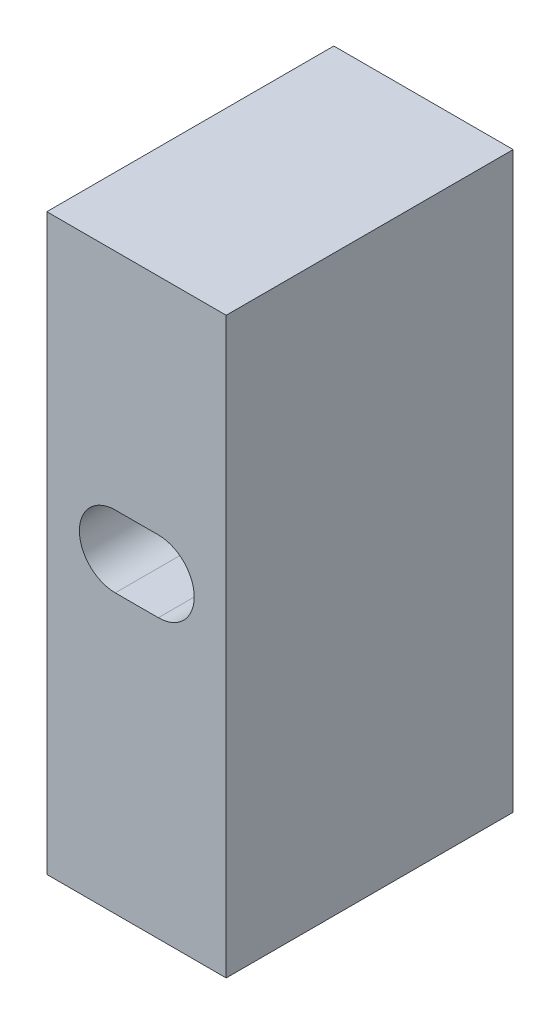
ISO-10303-21;
HEADER;
FILE_DESCRIPTION(('STEP AP214'),'2;1');
FILE_NAME('part.step','',(''),(''),'','','');
FILE_SCHEMA(('AUTOMOTIVE_DESIGN { 1 0 10303 214 1 1 1 1 }'));
ENDSEC;
DATA;
#1=APPLICATION_CONTEXT('core data for automotive mechanical design processes');
#2=APPLICATION_PROTOCOL_DEFINITION('international standard','automotive_design',2000,#1);
#3=PRODUCT_CONTEXT('',#1,'mechanical');
#4=PRODUCT('Part','Part','',(#3));
#5=PRODUCT_RELATED_PRODUCT_CATEGORY('part','',(#4));
#6=PRODUCT_DEFINITION_FORMATION('','',#4);
#7=PRODUCT_DEFINITION_CONTEXT('part definition',#1,'design');
#8=PRODUCT_DEFINITION('design','',#6,#7);
#9=PRODUCT_DEFINITION_SHAPE('','',#8);
#10=(LENGTH_UNIT() NAMED_UNIT(*) SI_UNIT(.MILLI.,.METRE.));
#11=(NAMED_UNIT(*) PLANE_ANGLE_UNIT() SI_UNIT($,.RADIAN.));
#12=(NAMED_UNIT(*) SI_UNIT($,.STERADIAN.) SOLID_ANGLE_UNIT());
#13=UNCERTAINTY_MEASURE_WITH_UNIT(LENGTH_MEASURE(1.E-05),#10,'distance_accuracy_value','');
#14=(GEOMETRIC_REPRESENTATION_CONTEXT(3) GLOBAL_UNCERTAINTY_ASSIGNED_CONTEXT((#13)) GLOBAL_UNIT_ASSIGNED_CONTEXT((#10,
#11,#12)) REPRESENTATION_CONTEXT('',''));
#15=CARTESIAN_POINT('',(0.,0.,0.));
#16=DIRECTION('',(0.,0.,1.));
#17=DIRECTION('',(1.,0.,0.));
#18=AXIS2_PLACEMENT_3D('',#15,#16,#17);
#19=CARTESIAN_POINT('',(0.,50.8,-25.4));
#20=DIRECTION('',(0.,0.,1.));
#21=DIRECTION('',(1.,0.,0.));
#22=AXIS2_PLACEMENT_3D('',#19,#20,#21);
#23=PLANE('',#22);
#24=DIRECTION('',(-1.,0.,0.));
#25=VECTOR('',#24,1.);
#26=CARTESIAN_POINT('',(0.,0.,-25.4));
#27=LINE('',#26,#25);
#28=CARTESIAN_POINT('',(15.875,0.,-25.4));
#29=VERTEX_POINT('',#28);
#30=CARTESIAN_POINT('',(0.,0.,-25.4));
#31=VERTEX_POINT('',#30);
#32=EDGE_CURVE('E230',#29,#31,#27,.T.);
#33=ORIENTED_EDGE('',*,*,#32,.T.);
#34=DIRECTION('',(0.,-1.,0.));
#35=VECTOR('',#34,1.);
#36=CARTESIAN_POINT('',(0.,50.8,-25.4));
#37=LINE('',#36,#35);
#38=CARTESIAN_POINT('',(0.,50.8,-25.4));
#39=VERTEX_POINT('',#38);
#40=EDGE_CURVE('E236',#39,#31,#37,.T.);
#41=ORIENTED_EDGE('',*,*,#40,.F.);
#42=DIRECTION('',(-1.,0.,0.));
#43=VECTOR('',#42,1.);
#44=CARTESIAN_POINT('',(0.,50.8,-25.4));
#45=LINE('',#44,#43);
#46=CARTESIAN_POINT('',(15.875,50.8,-25.4));
#47=VERTEX_POINT('',#46);
#48=EDGE_CURVE('E234',#47,#39,#45,.T.);
#49=ORIENTED_EDGE('',*,*,#48,.F.);
#50=DIRECTION('',(0.,-1.,0.));
#51=VECTOR('',#50,1.);
#52=CARTESIAN_POINT('',(15.875,50.8,-25.4));
#53=LINE('',#52,#51);
#54=EDGE_CURVE('E246',#47,#29,#53,.T.);
#55=ORIENTED_EDGE('',*,*,#54,.T.);
#56=EDGE_LOOP('',(#33,#41,#49,#55));
#57=FACE_BOUND('',#56,.T.);
#58=DIRECTION('',(1.,0.,0.));
#59=VECTOR('',#58,1.);
#60=CARTESIAN_POINT('',(6.05880185531833,30.9626000000028,-25.4));
#61=LINE('',#60,#59);
#62=CARTESIAN_POINT('',(6.05880185531833,30.9626000000028,-25.4));
#63=VERTEX_POINT('',#62);
#64=CARTESIAN_POINT('',(9.8688018553185,30.9626000000028,-25.4));
#65=VERTEX_POINT('',#64);
#66=EDGE_CURVE('E186',#63,#65,#61,.T.);
#67=ORIENTED_EDGE('',*,*,#66,.F.);
#68=CARTESIAN_POINT('',(6.05880185531834,27.7876000000028,-25.4));
#69=DIRECTION('',(0.,0.,1.));
#70=DIRECTION('',(1.,0.,0.));
#71=AXIS2_PLACEMENT_3D('',#68,#69,#70);
#72=CIRCLE('',#71,3.17499999999993);
#73=CARTESIAN_POINT('',(6.05880185531833,24.6126000000029,-25.4));
#74=VERTEX_POINT('',#73);
#75=EDGE_CURVE('E194',#63,#74,#72,.T.);
#76=ORIENTED_EDGE('',*,*,#75,.T.);
#77=DIRECTION('',(1.,0.,0.));
#78=VECTOR('',#77,1.);
#79=CARTESIAN_POINT('',(6.05880185531833,24.6126000000029,-25.4));
#80=LINE('',#79,#78);
#81=CARTESIAN_POINT('',(9.8688018553185,24.6126000000028,-25.4));
#82=VERTEX_POINT('',#81);
#83=EDGE_CURVE('E390',#74,#82,#80,.T.);
#84=ORIENTED_EDGE('',*,*,#83,.T.);
#85=CARTESIAN_POINT('',(9.8688018553185,27.7876000000028,-25.4));
#86=DIRECTION('',(0.,0.,1.));
#87=DIRECTION('',(1.,0.,0.));
#88=AXIS2_PLACEMENT_3D('',#85,#86,#87);
#89=CIRCLE('',#88,3.17499999999993);
#90=EDGE_CURVE('E208',#82,#65,#89,.T.);
#91=ORIENTED_EDGE('',*,*,#90,.T.);
#92=EDGE_LOOP('',(#67,#76,#84,#91));
#93=FACE_BOUND('',#92,.T.);
#94=ADVANCED_FACE('F107',(#57,#93),#23,.F.);
#95=CARTESIAN_POINT('',(0.,50.8,0.));
#96=DIRECTION('',(1.,0.,0.));
#97=DIRECTION('',(0.,0.,-1.));
#98=AXIS2_PLACEMENT_3D('',#95,#96,#97);
#99=PLANE('',#98);
#100=DIRECTION('',(0.,0.,1.));
#101=VECTOR('',#100,1.);
#102=CARTESIAN_POINT('',(0.,0.,0.));
#103=LINE('',#102,#101);
#104=CARTESIAN_POINT('',(0.,0.,0.));
#105=VERTEX_POINT('',#104);
#106=EDGE_CURVE('E225',#31,#105,#103,.T.);
#107=ORIENTED_EDGE('',*,*,#106,.T.);
#108=DIRECTION('',(0.,-1.,0.));
#109=VECTOR('',#108,1.);
#110=CARTESIAN_POINT('',(0.,50.8,0.));
#111=LINE('',#110,#109);
#112=CARTESIAN_POINT('',(0.,50.8,0.));
#113=VERTEX_POINT('',#112);
#114=EDGE_CURVE('E13',#113,#105,#111,.T.);
#115=ORIENTED_EDGE('',*,*,#114,.F.);
#116=DIRECTION('',(0.,0.,1.));
#117=VECTOR('',#116,1.);
#118=CARTESIAN_POINT('',(0.,50.8,0.));
#119=LINE('',#118,#117);
#120=EDGE_CURVE('E226',#39,#113,#119,.T.);
#121=ORIENTED_EDGE('',*,*,#120,.F.);
#122=ORIENTED_EDGE('',*,*,#40,.T.);
#123=EDGE_LOOP('',(#107,#115,#121,#122));
#124=FACE_BOUND('',#123,.T.);
#125=ADVANCED_FACE('F109',(#124),#99,.F.);
#126=CARTESIAN_POINT('',(0.,50.8,0.));
#127=DIRECTION('',(0.,0.,-1.));
#128=DIRECTION('',(-1.,0.,0.));
#129=AXIS2_PLACEMENT_3D('',#126,#127,#128);
#130=PLANE('',#129);
#131=CARTESIAN_POINT('',(6.05880185531834,27.7876000000028,0.));
#132=DIRECTION('',(0.,0.,1.));
#133=DIRECTION('',(1.,0.,0.));
#134=AXIS2_PLACEMENT_3D('',#131,#132,#133);
#135=CIRCLE('',#134,3.17499999999999);
#136=CARTESIAN_POINT('',(6.05880185531833,30.9626000000028,0.));
#137=VERTEX_POINT('',#136);
#138=CARTESIAN_POINT('',(6.05880185531834,24.6126000000028,0.));
#139=VERTEX_POINT('',#138);
#140=EDGE_CURVE('E185',#137,#139,#135,.T.);
#141=ORIENTED_EDGE('',*,*,#140,.F.);
#142=DIRECTION('',(1.,0.,0.));
#143=VECTOR('',#142,1.);
#144=CARTESIAN_POINT('',(6.05880185531833,30.9626000000028,0.));
#145=LINE('',#144,#143);
#146=CARTESIAN_POINT('',(9.8688018553185,30.9626000000028,0.));
#147=VERTEX_POINT('',#146);
#148=EDGE_CURVE('E175',#137,#147,#145,.T.);
#149=ORIENTED_EDGE('',*,*,#148,.T.);
#150=CARTESIAN_POINT('',(9.8688018553185,27.7876000000028,0.));
#151=DIRECTION('',(0.,0.,1.));
#152=DIRECTION('',(1.,0.,0.));
#153=AXIS2_PLACEMENT_3D('',#150,#151,#152);
#154=CIRCLE('',#153,3.17499999999999);
#155=CARTESIAN_POINT('',(9.8688018553185,24.6126000000028,0.));
#156=VERTEX_POINT('',#155);
#157=EDGE_CURVE('E196',#156,#147,#154,.T.);
#158=ORIENTED_EDGE('',*,*,#157,.F.);
#159=DIRECTION('',(1.,0.,0.));
#160=VECTOR('',#159,1.);
#161=CARTESIAN_POINT('',(6.05880185531833,24.6126000000028,0.));
#162=LINE('',#161,#160);
#163=EDGE_CURVE('E201',#139,#156,#162,.T.);
#164=ORIENTED_EDGE('',*,*,#163,.F.);
#165=EDGE_LOOP('',(#141,#149,#158,#164));
#166=FACE_BOUND('',#165,.T.);
#167=DIRECTION('',(1.,0.,0.));
#168=VECTOR('',#167,1.);
#169=CARTESIAN_POINT('',(0.,0.,0.));
#170=LINE('',#169,#168);
#171=CARTESIAN_POINT('',(15.875,0.,0.));
#172=VERTEX_POINT('',#171);
#173=EDGE_CURVE('E239',#105,#172,#170,.T.);
#174=ORIENTED_EDGE('',*,*,#173,.T.);
#175=DIRECTION('',(0.,-1.,0.));
#176=VECTOR('',#175,1.);
#177=CARTESIAN_POINT('',(15.875,50.8,0.));
#178=LINE('',#177,#176);
#179=CARTESIAN_POINT('',(15.875,50.8,0.));
#180=VERTEX_POINT('',#179);
#181=EDGE_CURVE('E115',#180,#172,#178,.T.);
#182=ORIENTED_EDGE('',*,*,#181,.F.);
#183=DIRECTION('',(1.,0.,0.));
#184=VECTOR('',#183,1.);
#185=CARTESIAN_POINT('',(0.,50.8,0.));
#186=LINE('',#185,#184);
#187=EDGE_CURVE('E229',#113,#180,#186,.T.);
#188=ORIENTED_EDGE('',*,*,#187,.F.);
#189=ORIENTED_EDGE('',*,*,#114,.T.);
#190=EDGE_LOOP('',(#174,#182,#188,#189));
#191=FACE_BOUND('',#190,.T.);
#192=ADVANCED_FACE('F199',(#166,#191),#130,.F.);
#193=CARTESIAN_POINT('',(15.875,50.8,0.));
#194=DIRECTION('',(-1.,0.,0.));
#195=DIRECTION('',(0.,0.,1.));
#196=AXIS2_PLACEMENT_3D('',#193,#194,#195);
#197=PLANE('',#196);
#198=DIRECTION('',(0.,0.,-1.));
#199=VECTOR('',#198,1.);
#200=CARTESIAN_POINT('',(15.875,0.,0.));
#201=LINE('',#200,#199);
#202=EDGE_CURVE('E241',#172,#29,#201,.T.);
#203=ORIENTED_EDGE('',*,*,#202,.T.);
#204=ORIENTED_EDGE('',*,*,#54,.F.);
#205=DIRECTION('',(0.,0.,-1.));
#206=VECTOR('',#205,1.);
#207=CARTESIAN_POINT('',(15.875,50.8,0.));
#208=LINE('',#207,#206);
#209=EDGE_CURVE('E232',#180,#47,#208,.T.);
#210=ORIENTED_EDGE('',*,*,#209,.F.);
#211=ORIENTED_EDGE('',*,*,#181,.T.);
#212=EDGE_LOOP('',(#203,#204,#210,#211));
#213=FACE_BOUND('',#212,.T.);
#214=ADVANCED_FACE('F253',(#213),#197,.F.);
#215=CARTESIAN_POINT('',(0.,50.8,0.));
#216=DIRECTION('',(0.,-1.,0.));
#217=DIRECTION('',(0.,0.,-1.));
#218=AXIS2_PLACEMENT_3D('',#215,#216,#217);
#219=PLANE('',#218);
#220=ORIENTED_EDGE('',*,*,#120,.T.);
#221=ORIENTED_EDGE('',*,*,#187,.T.);
#222=ORIENTED_EDGE('',*,*,#209,.T.);
#223=ORIENTED_EDGE('',*,*,#48,.T.);
#224=EDGE_LOOP('',(#220,#221,#222,#223));
#225=FACE_BOUND('',#224,.T.);
#226=ADVANCED_FACE('F267',(#225),#219,.F.);
#227=CARTESIAN_POINT('',(0.,0.,0.));
#228=DIRECTION('',(0.,-1.,0.));
#229=DIRECTION('',(0.,0.,-1.));
#230=AXIS2_PLACEMENT_3D('',#227,#228,#229);
#231=PLANE('',#230);
#232=CARTESIAN_POINT('',(7.9375,0.,-6.));
#233=DIRECTION('',(0.,-1.,0.));
#234=DIRECTION('',(0.,0.,-1.));
#235=AXIS2_PLACEMENT_3D('',#232,#233,#234);
#236=CIRCLE('',#235,1.89865);
#237=CARTESIAN_POINT('',(7.9375,0.,-7.89864999999999));
#238=VERTEX_POINT('',#237);
#239=EDGE_CURVE('E213',#238,#238,#236,.T.);
#240=ORIENTED_EDGE('',*,*,#239,.F.);
#241=EDGE_LOOP('',(#240));
#242=FACE_BOUND('',#241,.T.);
#243=CARTESIAN_POINT('',(7.9375,0.,-19.4));
#244=DIRECTION('',(0.,-1.,0.));
#245=DIRECTION('',(0.,0.,-1.));
#246=AXIS2_PLACEMENT_3D('',#243,#244,#245);
#247=CIRCLE('',#246,1.89865);
#248=CARTESIAN_POINT('',(7.9375,0.,-21.29865));
#249=VERTEX_POINT('',#248);
#250=EDGE_CURVE('E219',#249,#249,#247,.T.);
#251=ORIENTED_EDGE('',*,*,#250,.F.);
#252=EDGE_LOOP('',(#251));
#253=FACE_BOUND('',#252,.T.);
#254=ORIENTED_EDGE('',*,*,#106,.F.);
#255=ORIENTED_EDGE('',*,*,#32,.F.);
#256=ORIENTED_EDGE('',*,*,#202,.F.);
#257=ORIENTED_EDGE('',*,*,#173,.F.);
#258=EDGE_LOOP('',(#254,#255,#256,#257));
#259=FACE_BOUND('',#258,.T.);
#260=ADVANCED_FACE('F258',(#242,#253,#259),#231,.T.);
#261=CARTESIAN_POINT('',(7.9375,20.701,-19.4));
#262=DIRECTION('',(0.,-1.,0.));
#263=DIRECTION('',(0.,0.,-1.));
#264=AXIS2_PLACEMENT_3D('',#261,#262,#263);
#265=CONICAL_SURFACE('',#264,1.89864999999999,1.02974425867665);
#266=CARTESIAN_POINT('',(7.93749999999999,21.8418240143167,-19.4));
#267=VERTEX_POINT('',#266);
#268=VERTEX_LOOP('',#267);
#269=FACE_BOUND('',#268,.T.);
#270=CARTESIAN_POINT('',(7.9375,20.701,-19.4));
#271=DIRECTION('',(0.,-1.,0.));
#272=DIRECTION('',(0.,0.,-1.));
#273=AXIS2_PLACEMENT_3D('',#270,#271,#272);
#274=CIRCLE('',#273,1.89864999999999);
#275=CARTESIAN_POINT('',(7.9375,20.701,-21.29865));
#276=VERTEX_POINT('',#275);
#277=EDGE_CURVE('E222',#276,#276,#274,.T.);
#278=ORIENTED_EDGE('',*,*,#277,.T.);
#279=EDGE_LOOP('',(#278));
#280=FACE_BOUND('',#279,.T.);
#281=ADVANCED_FACE('F281',(#269,#280),#265,.F.);
#282=CARTESIAN_POINT('',(7.9375,0.,-19.4));
#283=DIRECTION('',(0.,-1.,0.));
#284=DIRECTION('',(0.,0.,-1.));
#285=AXIS2_PLACEMENT_3D('',#282,#283,#284);
#286=CYLINDRICAL_SURFACE('',#285,1.89865);
#287=ORIENTED_EDGE('',*,*,#277,.F.);
#288=EDGE_LOOP('',(#287));
#289=FACE_BOUND('',#288,.T.);
#290=ORIENTED_EDGE('',*,*,#250,.T.);
#291=EDGE_LOOP('',(#290));
#292=FACE_BOUND('',#291,.T.);
#293=ADVANCED_FACE('F287',(#289,#292),#286,.F.);
#294=CARTESIAN_POINT('',(7.9375,20.701,-6.));
#295=DIRECTION('',(0.,-1.,0.));
#296=DIRECTION('',(0.,0.,-1.));
#297=AXIS2_PLACEMENT_3D('',#294,#295,#296);
#298=CONICAL_SURFACE('',#297,1.89864999999999,1.02974425867665);
#299=CARTESIAN_POINT('',(7.93749999999999,21.8418240143167,-6.));
#300=VERTEX_POINT('',#299);
#301=VERTEX_LOOP('',#300);
#302=FACE_BOUND('',#301,.T.);
#303=CARTESIAN_POINT('',(7.9375,20.701,-6.));
#304=DIRECTION('',(0.,-1.,0.));
#305=DIRECTION('',(0.,0.,-1.));
#306=AXIS2_PLACEMENT_3D('',#303,#304,#305);
#307=CIRCLE('',#306,1.89864999999999);
#308=CARTESIAN_POINT('',(7.9375,20.701,-7.89864999999999));
#309=VERTEX_POINT('',#308);
#310=EDGE_CURVE('E216',#309,#309,#307,.T.);
#311=ORIENTED_EDGE('',*,*,#310,.T.);
#312=EDGE_LOOP('',(#311));
#313=FACE_BOUND('',#312,.T.);
#314=ADVANCED_FACE('F291',(#302,#313),#298,.F.);
#315=CARTESIAN_POINT('',(7.9375,0.,-6.));
#316=DIRECTION('',(0.,-1.,0.));
#317=DIRECTION('',(0.,0.,-1.));
#318=AXIS2_PLACEMENT_3D('',#315,#316,#317);
#319=CYLINDRICAL_SURFACE('',#318,1.89865);
#320=ORIENTED_EDGE('',*,*,#310,.F.);
#321=EDGE_LOOP('',(#320));
#322=FACE_BOUND('',#321,.T.);
#323=ORIENTED_EDGE('',*,*,#239,.T.);
#324=EDGE_LOOP('',(#323));
#325=FACE_BOUND('',#324,.T.);
#326=ADVANCED_FACE('F295',(#322,#325),#319,.F.);
#327=CARTESIAN_POINT('',(9.8688018553185,27.7876000000028,0.));
#328=DIRECTION('',(0.,0.,1.));
#329=DIRECTION('',(1.,0.,0.));
#330=AXIS2_PLACEMENT_3D('',#327,#328,#329);
#331=CYLINDRICAL_SURFACE('',#330,3.17499999999996);
#332=ORIENTED_EDGE('',*,*,#90,.F.);
#333=DIRECTION('',(0.,0.,1.));
#334=VECTOR('',#333,1.);
#335=CARTESIAN_POINT('',(9.8688018553185,24.6126000000028,0.));
#336=LINE('',#335,#334);
#337=EDGE_CURVE('E122',#156,#82,#336,.F.);
#338=ORIENTED_EDGE('',*,*,#337,.F.);
#339=ORIENTED_EDGE('',*,*,#157,.T.);
#340=DIRECTION('',(0.,0.,1.));
#341=VECTOR('',#340,1.);
#342=CARTESIAN_POINT('',(9.8688018553185,30.9626000000028,0.));
#343=LINE('',#342,#341);
#344=EDGE_CURVE('E181',#65,#147,#343,.T.);
#345=ORIENTED_EDGE('',*,*,#344,.F.);
#346=EDGE_LOOP('',(#332,#338,#339,#345));
#347=FACE_BOUND('',#346,.T.);
#348=ADVANCED_FACE('F299',(#347),#331,.F.);
#349=CARTESIAN_POINT('',(6.05880185531834,27.7876000000028,0.));
#350=DIRECTION('',(0.,0.,1.));
#351=DIRECTION('',(1.,0.,0.));
#352=AXIS2_PLACEMENT_3D('',#349,#350,#351);
#353=CYLINDRICAL_SURFACE('',#352,3.17499999999996);
#354=ORIENTED_EDGE('',*,*,#140,.T.);
#355=DIRECTION('',(0.,0.,1.));
#356=VECTOR('',#355,1.);
#357=CARTESIAN_POINT('',(6.05880185531834,24.6126000000028,0.));
#358=LINE('',#357,#356);
#359=EDGE_CURVE('E197',#74,#139,#358,.T.);
#360=ORIENTED_EDGE('',*,*,#359,.F.);
#361=ORIENTED_EDGE('',*,*,#75,.F.);
#362=DIRECTION('',(0.,0.,1.));
#363=VECTOR('',#362,1.);
#364=CARTESIAN_POINT('',(6.05880185531834,30.9626000000028,0.));
#365=LINE('',#364,#363);
#366=EDGE_CURVE('E178',#137,#63,#365,.F.);
#367=ORIENTED_EDGE('',*,*,#366,.F.);
#368=EDGE_LOOP('',(#354,#360,#361,#367));
#369=FACE_BOUND('',#368,.T.);
#370=ADVANCED_FACE('F190',(#369),#353,.F.);
#371=CARTESIAN_POINT('',(6.05880185531833,30.9626000000028,0.));
#372=DIRECTION('',(0.,1.,0.));
#373=DIRECTION('',(0.,0.,1.));
#374=AXIS2_PLACEMENT_3D('',#371,#372,#373);
#375=PLANE('',#374);
#376=ORIENTED_EDGE('',*,*,#344,.T.);
#377=ORIENTED_EDGE('',*,*,#148,.F.);
#378=ORIENTED_EDGE('',*,*,#366,.T.);
#379=ORIENTED_EDGE('',*,*,#66,.T.);
#380=EDGE_LOOP('',(#376,#377,#378,#379));
#381=FACE_BOUND('',#380,.T.);
#382=ADVANCED_FACE('F177',(#381),#375,.F.);
#383=CARTESIAN_POINT('',(6.05880185531833,24.6126000000028,0.));
#384=DIRECTION('',(0.,-1.,0.));
#385=DIRECTION('',(0.,0.,-1.));
#386=AXIS2_PLACEMENT_3D('',#383,#384,#385);
#387=PLANE('',#386);
#388=ORIENTED_EDGE('',*,*,#337,.T.);
#389=ORIENTED_EDGE('',*,*,#83,.F.);
#390=ORIENTED_EDGE('',*,*,#359,.T.);
#391=ORIENTED_EDGE('',*,*,#163,.T.);
#392=EDGE_LOOP('',(#388,#389,#390,#391));
#393=FACE_BOUND('',#392,.T.);
#394=ADVANCED_FACE('F307',(#393),#387,.F.);
#395=CLOSED_SHELL('',(#94,#125,#192,#214,#226,#260,#281,#293,#314,#326,#348,#370,#382,#394));
#396=MANIFOLD_SOLID_BREP('B2',#395);
#397=ADVANCED_BREP_SHAPE_REPRESENTATION('',(#18,#396),#14);
#398=SHAPE_DEFINITION_REPRESENTATION(#9,#397);
ENDSEC;
END-ISO-10303-21;
